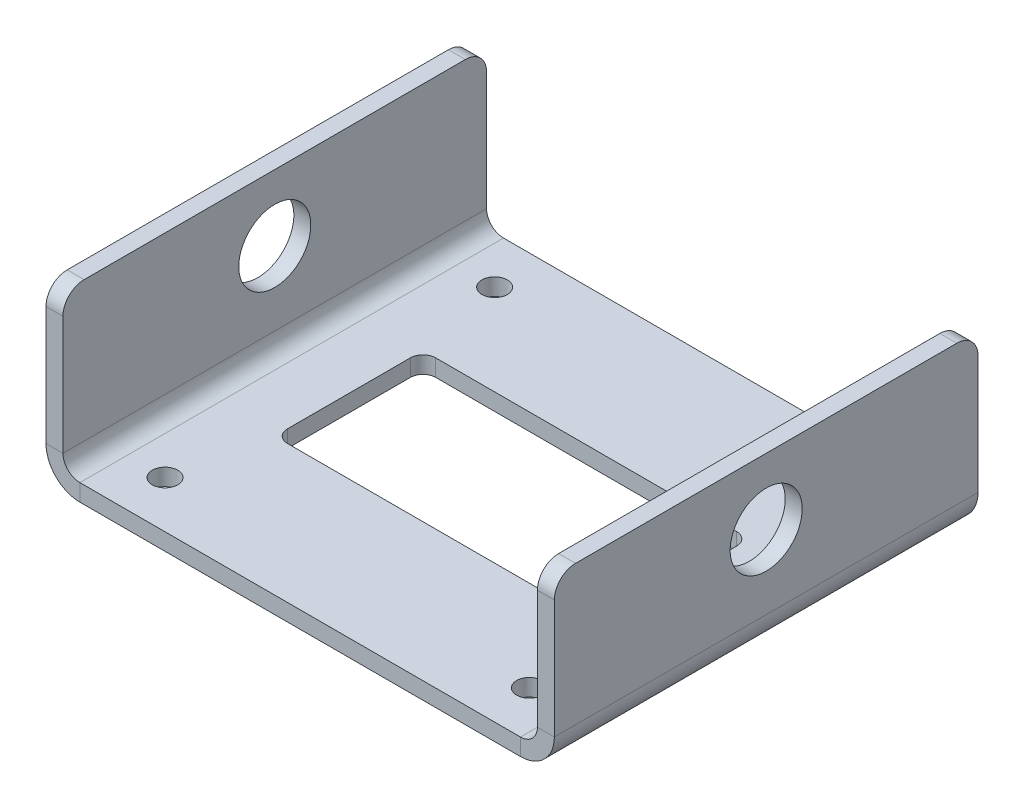
ISO-10303-21;
HEADER;
FILE_DESCRIPTION(('STEP AP214'),'2;1');
FILE_NAME('part.step','',(''),(''),'','','');
FILE_SCHEMA(('AUTOMOTIVE_DESIGN { 1 0 10303 214 1 1 1 1 }'));
ENDSEC;
DATA;
#1=APPLICATION_CONTEXT('core data for automotive mechanical design processes');
#2=APPLICATION_PROTOCOL_DEFINITION('international standard','automotive_design',2000,#1);
#3=PRODUCT_CONTEXT('',#1,'mechanical');
#4=PRODUCT('Part','Part','',(#3));
#5=PRODUCT_RELATED_PRODUCT_CATEGORY('part','',(#4));
#6=PRODUCT_DEFINITION_FORMATION('','',#4);
#7=PRODUCT_DEFINITION_CONTEXT('part definition',#1,'design');
#8=PRODUCT_DEFINITION('design','',#6,#7);
#9=PRODUCT_DEFINITION_SHAPE('','',#8);
#10=(LENGTH_UNIT() NAMED_UNIT(*) SI_UNIT(.MILLI.,.METRE.));
#11=(NAMED_UNIT(*) PLANE_ANGLE_UNIT() SI_UNIT($,.RADIAN.));
#12=(NAMED_UNIT(*) SI_UNIT($,.STERADIAN.) SOLID_ANGLE_UNIT());
#13=UNCERTAINTY_MEASURE_WITH_UNIT(LENGTH_MEASURE(1.E-05),#10,'distance_accuracy_value','');
#14=(GEOMETRIC_REPRESENTATION_CONTEXT(3) GLOBAL_UNCERTAINTY_ASSIGNED_CONTEXT((#13)) GLOBAL_UNIT_ASSIGNED_CONTEXT((#10,
#11,#12)) REPRESENTATION_CONTEXT('',''));
#15=CARTESIAN_POINT('',(0.,0.,0.));
#16=DIRECTION('',(0.,0.,1.));
#17=DIRECTION('',(1.,0.,0.));
#18=AXIS2_PLACEMENT_3D('',#15,#16,#17);
#19=CARTESIAN_POINT('',(52.,0.,100.));
#20=DIRECTION('',(0.,0.,1.));
#21=DIRECTION('',(1.,0.,0.));
#22=AXIS2_PLACEMENT_3D('',#19,#20,#21);
#23=PLANE('',#22);
#24=DIRECTION('',(0.,1.,0.));
#25=VECTOR('',#24,1.);
#26=CARTESIAN_POINT('',(52.,0.,100.));
#27=LINE('',#26,#25);
#28=CARTESIAN_POINT('',(52.,0.,100.));
#29=VERTEX_POINT('',#28);
#30=CARTESIAN_POINT('',(52.,4.,100.));
#31=VERTEX_POINT('',#30);
#32=EDGE_CURVE('E399',#29,#31,#27,.T.);
#33=ORIENTED_EDGE('',*,*,#32,.F.);
#34=CARTESIAN_POINT('',(52.,8.,100.));
#35=DIRECTION('',(0.,0.,1.));
#36=DIRECTION('',(1.,0.,0.));
#37=AXIS2_PLACEMENT_3D('',#34,#35,#36);
#38=CIRCLE('',#37,8.);
#39=CARTESIAN_POINT('',(60.,8.,100.));
#40=VERTEX_POINT('',#39);
#41=EDGE_CURVE('E307',#40,#29,#38,.F.);
#42=ORIENTED_EDGE('',*,*,#41,.F.);
#43=DIRECTION('',(1.,0.,0.));
#44=VECTOR('',#43,1.);
#45=CARTESIAN_POINT('',(56.,8.,100.));
#46=LINE('',#45,#44);
#47=CARTESIAN_POINT('',(56.,8.,100.));
#48=VERTEX_POINT('',#47);
#49=EDGE_CURVE('E396',#48,#40,#46,.T.);
#50=ORIENTED_EDGE('',*,*,#49,.F.);
#51=CARTESIAN_POINT('',(52.,8.,100.));
#52=DIRECTION('',(0.,0.,1.));
#53=DIRECTION('',(1.,0.,0.));
#54=AXIS2_PLACEMENT_3D('',#51,#52,#53);
#55=CIRCLE('',#54,4.);
#56=EDGE_CURVE('E314',#48,#31,#55,.F.);
#57=ORIENTED_EDGE('',*,*,#56,.T.);
#58=EDGE_LOOP('',(#33,#42,#50,#57));
#59=FACE_BOUND('',#58,.T.);
#60=ADVANCED_FACE('F38',(#59),#23,.T.);
#61=CARTESIAN_POINT('',(56.,8.,100.));
#62=DIRECTION('',(0.,0.,1.));
#63=DIRECTION('',(1.,0.,0.));
#64=AXIS2_PLACEMENT_3D('',#61,#62,#63);
#65=PLANE('',#64);
#66=DIRECTION('',(-1.,0.,0.));
#67=VECTOR('',#66,1.);
#68=CARTESIAN_POINT('',(-60.,0.,100.));
#69=LINE('',#68,#67);
#70=CARTESIAN_POINT('',(-52.,0.,100.));
#71=VERTEX_POINT('',#70);
#72=EDGE_CURVE('E304',#29,#71,#69,.T.);
#73=ORIENTED_EDGE('',*,*,#72,.F.);
#74=ORIENTED_EDGE('',*,*,#32,.T.);
#75=DIRECTION('',(1.,0.,0.));
#76=VECTOR('',#75,1.);
#77=CARTESIAN_POINT('',(-60.,4.,100.));
#78=LINE('',#77,#76);
#79=CARTESIAN_POINT('',(-52.,4.,100.));
#80=VERTEX_POINT('',#79);
#81=EDGE_CURVE('E317',#31,#80,#78,.F.);
#82=ORIENTED_EDGE('',*,*,#81,.T.);
#83=DIRECTION('',(0.,-1.,0.));
#84=VECTOR('',#83,1.);
#85=CARTESIAN_POINT('',(-52.,4.,100.));
#86=LINE('',#85,#84);
#87=EDGE_CURVE('E387',#80,#71,#86,.T.);
#88=ORIENTED_EDGE('',*,*,#87,.T.);
#89=EDGE_LOOP('',(#73,#74,#82,#88));
#90=FACE_BOUND('',#89,.T.);
#91=ADVANCED_FACE('F467',(#90),#65,.T.);
#92=CARTESIAN_POINT('',(60.,8.,0.));
#93=DIRECTION('',(0.,0.,-1.));
#94=DIRECTION('',(-1.,0.,0.));
#95=AXIS2_PLACEMENT_3D('',#92,#93,#94);
#96=PLANE('',#95);
#97=DIRECTION('',(-1.,0.,0.));
#98=VECTOR('',#97,1.);
#99=CARTESIAN_POINT('',(60.,8.,0.));
#100=LINE('',#99,#98);
#101=CARTESIAN_POINT('',(60.,8.,0.));
#102=VERTEX_POINT('',#101);
#103=CARTESIAN_POINT('',(56.,8.,0.));
#104=VERTEX_POINT('',#103);
#105=EDGE_CURVE('E393',#102,#104,#100,.T.);
#106=ORIENTED_EDGE('',*,*,#105,.F.);
#107=CARTESIAN_POINT('',(52.,8.,0.));
#108=DIRECTION('',(0.,0.,1.));
#109=DIRECTION('',(1.,0.,0.));
#110=AXIS2_PLACEMENT_3D('',#107,#108,#109);
#111=CIRCLE('',#110,8.);
#112=CARTESIAN_POINT('',(52.,0.,0.));
#113=VERTEX_POINT('',#112);
#114=EDGE_CURVE('E335',#102,#113,#111,.F.);
#115=ORIENTED_EDGE('',*,*,#114,.T.);
#116=DIRECTION('',(0.,-1.,0.));
#117=VECTOR('',#116,1.);
#118=CARTESIAN_POINT('',(52.,4.,0.));
#119=LINE('',#118,#117);
#120=CARTESIAN_POINT('',(52.,4.,0.));
#121=VERTEX_POINT('',#120);
#122=EDGE_CURVE('E391',#121,#113,#119,.T.);
#123=ORIENTED_EDGE('',*,*,#122,.F.);
#124=CARTESIAN_POINT('',(52.,8.,0.));
#125=DIRECTION('',(0.,0.,1.));
#126=DIRECTION('',(1.,0.,0.));
#127=AXIS2_PLACEMENT_3D('',#124,#125,#126);
#128=CIRCLE('',#127,4.);
#129=EDGE_CURVE('E342',#104,#121,#128,.F.);
#130=ORIENTED_EDGE('',*,*,#129,.F.);
#131=EDGE_LOOP('',(#106,#115,#123,#130));
#132=FACE_BOUND('',#131,.T.);
#133=ADVANCED_FACE('F527',(#132),#96,.T.);
#134=CARTESIAN_POINT('',(52.,4.,0.));
#135=DIRECTION('',(0.,0.,-1.));
#136=DIRECTION('',(-1.,0.,0.));
#137=AXIS2_PLACEMENT_3D('',#134,#135,#136);
#138=PLANE('',#137);
#139=DIRECTION('',(0.,1.,0.));
#140=VECTOR('',#139,1.);
#141=CARTESIAN_POINT('',(56.,0.,0.));
#142=LINE('',#141,#140);
#143=CARTESIAN_POINT('',(56.,36.,0.));
#144=VERTEX_POINT('',#143);
#145=EDGE_CURVE('E340',#144,#104,#142,.F.);
#146=ORIENTED_EDGE('',*,*,#145,.F.);
#147=DIRECTION('',(1.,0.,0.));
#148=VECTOR('',#147,1.);
#149=CARTESIAN_POINT('',(52.,36.,0.));
#150=LINE('',#149,#148);
#151=CARTESIAN_POINT('',(60.,36.,0.));
#152=VERTEX_POINT('',#151);
#153=EDGE_CURVE('E421',#144,#152,#150,.T.);
#154=ORIENTED_EDGE('',*,*,#153,.T.);
#155=DIRECTION('',(0.,-1.,0.));
#156=VECTOR('',#155,1.);
#157=CARTESIAN_POINT('',(60.,0.,0.));
#158=LINE('',#157,#156);
#159=EDGE_CURVE('E338',#152,#102,#158,.T.);
#160=ORIENTED_EDGE('',*,*,#159,.T.);
#161=ORIENTED_EDGE('',*,*,#105,.T.);
#162=EDGE_LOOP('',(#146,#154,#160,#161));
#163=FACE_BOUND('',#162,.T.);
#164=ADVANCED_FACE('F441',(#163),#138,.T.);
#165=CARTESIAN_POINT('',(-60.,8.,100.));
#166=DIRECTION('',(0.,0.,1.));
#167=DIRECTION('',(1.,0.,0.));
#168=AXIS2_PLACEMENT_3D('',#165,#166,#167);
#169=PLANE('',#168);
#170=DIRECTION('',(1.,0.,0.));
#171=VECTOR('',#170,1.);
#172=CARTESIAN_POINT('',(-60.,8.,100.));
#173=LINE('',#172,#171);
#174=CARTESIAN_POINT('',(-60.,8.,100.));
#175=VERTEX_POINT('',#174);
#176=CARTESIAN_POINT('',(-56.,8.,100.));
#177=VERTEX_POINT('',#176);
#178=EDGE_CURVE('E389',#175,#177,#173,.T.);
#179=ORIENTED_EDGE('',*,*,#178,.F.);
#180=CARTESIAN_POINT('',(-52.,8.,100.));
#181=DIRECTION('',(0.,0.,1.));
#182=DIRECTION('',(1.,0.,0.));
#183=AXIS2_PLACEMENT_3D('',#180,#181,#182);
#184=CIRCLE('',#183,8.);
#185=EDGE_CURVE('E301',#71,#175,#184,.F.);
#186=ORIENTED_EDGE('',*,*,#185,.F.);
#187=ORIENTED_EDGE('',*,*,#87,.F.);
#188=CARTESIAN_POINT('',(-52.,8.,100.));
#189=DIRECTION('',(0.,0.,1.));
#190=DIRECTION('',(1.,0.,0.));
#191=AXIS2_PLACEMENT_3D('',#188,#189,#190);
#192=CIRCLE('',#191,4.);
#193=EDGE_CURVE('E320',#80,#177,#192,.F.);
#194=ORIENTED_EDGE('',*,*,#193,.T.);
#195=EDGE_LOOP('',(#179,#186,#187,#194));
#196=FACE_BOUND('',#195,.T.);
#197=ADVANCED_FACE('F476',(#196),#169,.T.);
#198=CARTESIAN_POINT('',(-52.,4.,100.));
#199=DIRECTION('',(0.,0.,1.));
#200=DIRECTION('',(1.,0.,0.));
#201=AXIS2_PLACEMENT_3D('',#198,#199,#200);
#202=PLANE('',#201);
#203=DIRECTION('',(0.,1.,0.));
#204=VECTOR('',#203,1.);
#205=CARTESIAN_POINT('',(-56.,0.,100.));
#206=LINE('',#205,#204);
#207=CARTESIAN_POINT('',(-56.,36.,100.));
#208=VERTEX_POINT('',#207);
#209=EDGE_CURVE('E294',#177,#208,#206,.T.);
#210=ORIENTED_EDGE('',*,*,#209,.T.);
#211=DIRECTION('',(1.,0.,0.));
#212=VECTOR('',#211,1.);
#213=CARTESIAN_POINT('',(-52.,36.,100.));
#214=LINE('',#213,#212);
#215=CARTESIAN_POINT('',(-60.,36.,100.));
#216=VERTEX_POINT('',#215);
#217=EDGE_CURVE('E412',#208,#216,#214,.F.);
#218=ORIENTED_EDGE('',*,*,#217,.T.);
#219=DIRECTION('',(0.,1.,0.));
#220=VECTOR('',#219,1.);
#221=CARTESIAN_POINT('',(-60.,0.,100.));
#222=LINE('',#221,#220);
#223=EDGE_CURVE('E297',#175,#216,#222,.T.);
#224=ORIENTED_EDGE('',*,*,#223,.F.);
#225=ORIENTED_EDGE('',*,*,#178,.T.);
#226=EDGE_LOOP('',(#210,#218,#224,#225));
#227=FACE_BOUND('',#226,.T.);
#228=ADVANCED_FACE('F486',(#227),#202,.T.);
#229=CARTESIAN_POINT('',(-52.,0.,0.));
#230=DIRECTION('',(0.,0.,-1.));
#231=DIRECTION('',(-1.,0.,0.));
#232=AXIS2_PLACEMENT_3D('',#229,#230,#231);
#233=PLANE('',#232);
#234=DIRECTION('',(0.,1.,0.));
#235=VECTOR('',#234,1.);
#236=CARTESIAN_POINT('',(-52.,0.,0.));
#237=LINE('',#236,#235);
#238=CARTESIAN_POINT('',(-52.,0.,0.));
#239=VERTEX_POINT('',#238);
#240=CARTESIAN_POINT('',(-52.,4.,0.));
#241=VERTEX_POINT('',#240);
#242=EDGE_CURVE('E385',#239,#241,#237,.T.);
#243=ORIENTED_EDGE('',*,*,#242,.F.);
#244=CARTESIAN_POINT('',(-52.,8.,0.));
#245=DIRECTION('',(0.,0.,1.));
#246=DIRECTION('',(1.,0.,0.));
#247=AXIS2_PLACEMENT_3D('',#244,#245,#246);
#248=CIRCLE('',#247,8.);
#249=CARTESIAN_POINT('',(-60.,8.,0.));
#250=VERTEX_POINT('',#249);
#251=EDGE_CURVE('E329',#239,#250,#248,.F.);
#252=ORIENTED_EDGE('',*,*,#251,.T.);
#253=DIRECTION('',(-1.,0.,0.));
#254=VECTOR('',#253,1.);
#255=CARTESIAN_POINT('',(-56.,8.,0.));
#256=LINE('',#255,#254);
#257=CARTESIAN_POINT('',(-56.,8.,0.));
#258=VERTEX_POINT('',#257);
#259=EDGE_CURVE('E383',#258,#250,#256,.T.);
#260=ORIENTED_EDGE('',*,*,#259,.F.);
#261=CARTESIAN_POINT('',(-52.,8.,0.));
#262=DIRECTION('',(0.,0.,1.));
#263=DIRECTION('',(1.,0.,0.));
#264=AXIS2_PLACEMENT_3D('',#261,#262,#263);
#265=CIRCLE('',#264,4.);
#266=EDGE_CURVE('E298',#241,#258,#265,.F.);
#267=ORIENTED_EDGE('',*,*,#266,.F.);
#268=EDGE_LOOP('',(#243,#252,#260,#267));
#269=FACE_BOUND('',#268,.T.);
#270=ADVANCED_FACE('F506',(#269),#233,.T.);
#271=CARTESIAN_POINT('',(-56.,8.,0.));
#272=DIRECTION('',(0.,0.,-1.));
#273=DIRECTION('',(-1.,0.,0.));
#274=AXIS2_PLACEMENT_3D('',#271,#272,#273);
#275=PLANE('',#274);
#276=DIRECTION('',(-1.,0.,0.));
#277=VECTOR('',#276,1.);
#278=CARTESIAN_POINT('',(-60.,0.,0.));
#279=LINE('',#278,#277);
#280=EDGE_CURVE('E332',#113,#239,#279,.T.);
#281=ORIENTED_EDGE('',*,*,#280,.T.);
#282=ORIENTED_EDGE('',*,*,#242,.T.);
#283=DIRECTION('',(1.,0.,0.));
#284=VECTOR('',#283,1.);
#285=CARTESIAN_POINT('',(-60.,4.,0.));
#286=LINE('',#285,#284);
#287=EDGE_CURVE('E345',#121,#241,#286,.F.);
#288=ORIENTED_EDGE('',*,*,#287,.F.);
#289=ORIENTED_EDGE('',*,*,#122,.T.);
#290=EDGE_LOOP('',(#281,#282,#288,#289));
#291=FACE_BOUND('',#290,.T.);
#292=ADVANCED_FACE('F512',(#291),#275,.T.);
#293=CARTESIAN_POINT('',(-56.,0.,100.));
#294=DIRECTION('',(-1.,0.,0.));
#295=DIRECTION('',(0.,0.,1.));
#296=AXIS2_PLACEMENT_3D('',#293,#294,#295);
#297=PLANE('',#296);
#298=CARTESIAN_POINT('',(-56.,25.4,50.));
#299=DIRECTION('',(-1.,0.,0.));
#300=DIRECTION('',(0.,0.,1.));
#301=AXIS2_PLACEMENT_3D('',#298,#299,#300);
#302=CIRCLE('',#301,8.5);
#303=CARTESIAN_POINT('',(-56.,25.4,58.5));
#304=VERTEX_POINT('',#303);
#305=EDGE_CURVE('E290',#304,#304,#302,.T.);
#306=ORIENTED_EDGE('',*,*,#305,.T.);
#307=EDGE_LOOP('',(#306));
#308=FACE_BOUND('',#307,.T.);
#309=DIRECTION('',(0.,0.,-1.));
#310=VECTOR('',#309,1.);
#311=CARTESIAN_POINT('',(-56.,41.,100.));
#312=LINE('',#311,#310);
#313=CARTESIAN_POINT('',(-56.,41.,95.));
#314=VERTEX_POINT('',#313);
#315=CARTESIAN_POINT('',(-56.,41.,5.));
#316=VERTEX_POINT('',#315);
#317=EDGE_CURVE('E380',#314,#316,#312,.T.);
#318=ORIENTED_EDGE('',*,*,#317,.F.);
#319=CARTESIAN_POINT('',(-56.,36.,95.));
#320=DIRECTION('',(-1.,0.,0.));
#321=DIRECTION('',(0.,0.,1.));
#322=AXIS2_PLACEMENT_3D('',#319,#320,#321);
#323=CIRCLE('',#322,5.);
#324=EDGE_CURVE('E410',#314,#208,#323,.F.);
#325=ORIENTED_EDGE('',*,*,#324,.T.);
#326=ORIENTED_EDGE('',*,*,#209,.F.);
#327=DIRECTION('',(0.,0.,-1.));
#328=VECTOR('',#327,1.);
#329=CARTESIAN_POINT('',(-56.,8.,100.));
#330=LINE('',#329,#328);
#331=EDGE_CURVE('E323',#177,#258,#330,.T.);
#332=ORIENTED_EDGE('',*,*,#331,.T.);
#333=DIRECTION('',(0.,1.,0.));
#334=VECTOR('',#333,1.);
#335=CARTESIAN_POINT('',(-56.,0.,0.));
#336=LINE('',#335,#334);
#337=CARTESIAN_POINT('',(-56.,36.,0.));
#338=VERTEX_POINT('',#337);
#339=EDGE_CURVE('E293',#258,#338,#336,.T.);
#340=ORIENTED_EDGE('',*,*,#339,.T.);
#341=CARTESIAN_POINT('',(-56.,36.,5.));
#342=DIRECTION('',(-1.,0.,0.));
#343=DIRECTION('',(0.,0.,1.));
#344=AXIS2_PLACEMENT_3D('',#341,#342,#343);
#345=CIRCLE('',#344,5.);
#346=EDGE_CURVE('E408',#338,#316,#345,.F.);
#347=ORIENTED_EDGE('',*,*,#346,.T.);
#348=EDGE_LOOP('',(#318,#325,#326,#332,#340,#347));
#349=FACE_BOUND('',#348,.T.);
#350=ADVANCED_FACE('F510',(#308,#349),#297,.F.);
#351=CARTESIAN_POINT('',(-60.,41.,100.));
#352=DIRECTION('',(0.,1.,0.));
#353=DIRECTION('',(0.,0.,1.));
#354=AXIS2_PLACEMENT_3D('',#351,#352,#353);
#355=PLANE('',#354);
#356=DIRECTION('',(0.,0.,-1.));
#357=VECTOR('',#356,1.);
#358=CARTESIAN_POINT('',(-60.,41.,100.));
#359=LINE('',#358,#357);
#360=CARTESIAN_POINT('',(-60.,41.,95.));
#361=VERTEX_POINT('',#360);
#362=CARTESIAN_POINT('',(-60.,41.,5.));
#363=VERTEX_POINT('',#362);
#364=EDGE_CURVE('E377',#361,#363,#359,.T.);
#365=ORIENTED_EDGE('',*,*,#364,.F.);
#366=DIRECTION('',(1.,0.,0.));
#367=VECTOR('',#366,1.);
#368=CARTESIAN_POINT('',(-60.,41.,95.));
#369=LINE('',#368,#367);
#370=EDGE_CURVE('E405',#361,#314,#369,.T.);
#371=ORIENTED_EDGE('',*,*,#370,.T.);
#372=ORIENTED_EDGE('',*,*,#317,.T.);
#373=DIRECTION('',(1.,0.,0.));
#374=VECTOR('',#373,1.);
#375=CARTESIAN_POINT('',(-60.,41.,5.));
#376=LINE('',#375,#374);
#377=EDGE_CURVE('E401',#316,#363,#376,.F.);
#378=ORIENTED_EDGE('',*,*,#377,.T.);
#379=EDGE_LOOP('',(#365,#371,#372,#378));
#380=FACE_BOUND('',#379,.T.);
#381=ADVANCED_FACE('F495',(#380),#355,.T.);
#382=CARTESIAN_POINT('',(-60.,0.,100.));
#383=DIRECTION('',(-1.,0.,0.));
#384=DIRECTION('',(0.,0.,1.));
#385=AXIS2_PLACEMENT_3D('',#382,#383,#384);
#386=PLANE('',#385);
#387=CARTESIAN_POINT('',(-60.,25.4,50.));
#388=DIRECTION('',(-1.,0.,0.));
#389=DIRECTION('',(0.,0.,1.));
#390=AXIS2_PLACEMENT_3D('',#387,#388,#389);
#391=CIRCLE('',#390,8.5);
#392=CARTESIAN_POINT('',(-60.,25.4,58.5));
#393=VERTEX_POINT('',#392);
#394=EDGE_CURVE('E286',#393,#393,#391,.F.);
#395=ORIENTED_EDGE('',*,*,#394,.T.);
#396=EDGE_LOOP('',(#395));
#397=FACE_BOUND('',#396,.T.);
#398=ORIENTED_EDGE('',*,*,#223,.T.);
#399=CARTESIAN_POINT('',(-60.,36.,95.));
#400=DIRECTION('',(-1.,0.,0.));
#401=DIRECTION('',(0.,0.,1.));
#402=AXIS2_PLACEMENT_3D('',#399,#400,#401);
#403=CIRCLE('',#402,5.);
#404=EDGE_CURVE('E416',#216,#361,#403,.T.);
#405=ORIENTED_EDGE('',*,*,#404,.T.);
#406=ORIENTED_EDGE('',*,*,#364,.T.);
#407=CARTESIAN_POINT('',(-60.,36.,5.));
#408=DIRECTION('',(-1.,0.,0.));
#409=DIRECTION('',(0.,0.,1.));
#410=AXIS2_PLACEMENT_3D('',#407,#408,#409);
#411=CIRCLE('',#410,5.);
#412=CARTESIAN_POINT('',(-60.,36.,0.));
#413=VERTEX_POINT('',#412);
#414=EDGE_CURVE('E414',#363,#413,#411,.T.);
#415=ORIENTED_EDGE('',*,*,#414,.T.);
#416=DIRECTION('',(0.,1.,0.));
#417=VECTOR('',#416,1.);
#418=CARTESIAN_POINT('',(-60.,0.,0.));
#419=LINE('',#418,#417);
#420=EDGE_CURVE('E326',#250,#413,#419,.T.);
#421=ORIENTED_EDGE('',*,*,#420,.F.);
#422=DIRECTION('',(0.,0.,-1.));
#423=VECTOR('',#422,1.);
#424=CARTESIAN_POINT('',(-60.,8.,100.));
#425=LINE('',#424,#423);
#426=EDGE_CURVE('E374',#175,#250,#425,.T.);
#427=ORIENTED_EDGE('',*,*,#426,.F.);
#428=EDGE_LOOP('',(#398,#405,#406,#415,#421,#427));
#429=FACE_BOUND('',#428,.T.);
#430=ADVANCED_FACE('F484',(#397,#429),#386,.T.);
#431=CARTESIAN_POINT('',(-52.,8.,100.));
#432=DIRECTION('',(0.,0.,-1.));
#433=DIRECTION('',(-1.,0.,0.));
#434=AXIS2_PLACEMENT_3D('',#431,#432,#433);
#435=CYLINDRICAL_SURFACE('',#434,8.);
#436=ORIENTED_EDGE('',*,*,#251,.F.);
#437=DIRECTION('',(0.,0.,-1.));
#438=VECTOR('',#437,1.);
#439=CARTESIAN_POINT('',(-52.,0.,100.));
#440=LINE('',#439,#438);
#441=EDGE_CURVE('E371',#71,#239,#440,.T.);
#442=ORIENTED_EDGE('',*,*,#441,.F.);
#443=ORIENTED_EDGE('',*,*,#185,.T.);
#444=ORIENTED_EDGE('',*,*,#426,.T.);
#445=EDGE_LOOP('',(#436,#442,#443,#444));
#446=FACE_BOUND('',#445,.T.);
#447=ADVANCED_FACE('F475',(#446),#435,.T.);
#448=CARTESIAN_POINT('',(-60.,0.,100.));
#449=DIRECTION('',(0.,-1.,0.));
#450=DIRECTION('',(0.,0.,-1.));
#451=AXIS2_PLACEMENT_3D('',#448,#449,#450);
#452=PLANE('',#451);
#453=CARTESIAN_POINT('',(43.,0.,11.1));
#454=DIRECTION('',(0.,-1.,0.));
#455=DIRECTION('',(0.,0.,-1.));
#456=AXIS2_PLACEMENT_3D('',#453,#454,#455);
#457=CIRCLE('',#456,3.);
#458=CARTESIAN_POINT('',(43.,0.,8.09999999999999));
#459=VERTEX_POINT('',#458);
#460=EDGE_CURVE('E268',#459,#459,#457,.F.);
#461=ORIENTED_EDGE('',*,*,#460,.T.);
#462=EDGE_LOOP('',(#461));
#463=FACE_BOUND('',#462,.T.);
#464=CARTESIAN_POINT('',(-43.,0.,88.9));
#465=DIRECTION('',(0.,-1.,0.));
#466=DIRECTION('',(0.,0.,-1.));
#467=AXIS2_PLACEMENT_3D('',#464,#465,#466);
#468=CIRCLE('',#467,2.99999999999999);
#469=CARTESIAN_POINT('',(-43.,0.,85.9));
#470=VERTEX_POINT('',#469);
#471=EDGE_CURVE('E274',#470,#470,#468,.F.);
#472=ORIENTED_EDGE('',*,*,#471,.T.);
#473=EDGE_LOOP('',(#472));
#474=FACE_BOUND('',#473,.T.);
#475=CARTESIAN_POINT('',(43.,0.,88.9));
#476=DIRECTION('',(0.,-1.,0.));
#477=DIRECTION('',(0.,0.,-1.));
#478=AXIS2_PLACEMENT_3D('',#475,#476,#477);
#479=CIRCLE('',#478,2.99999999999999);
#480=CARTESIAN_POINT('',(43.,0.,85.9));
#481=VERTEX_POINT('',#480);
#482=EDGE_CURVE('E211',#481,#481,#479,.F.);
#483=ORIENTED_EDGE('',*,*,#482,.T.);
#484=EDGE_LOOP('',(#483));
#485=FACE_BOUND('',#484,.T.);
#486=CARTESIAN_POINT('',(-35.5,0.,35.5));
#487=DIRECTION('',(0.,-1.,0.));
#488=DIRECTION('',(0.,0.,-1.));
#489=AXIS2_PLACEMENT_3D('',#486,#487,#488);
#490=CIRCLE('',#489,3.);
#491=CARTESIAN_POINT('',(-35.5,0.,32.5));
#492=VERTEX_POINT('',#491);
#493=CARTESIAN_POINT('',(-38.5,0.,35.5));
#494=VERTEX_POINT('',#493);
#495=EDGE_CURVE('E216',#492,#494,#490,.F.);
#496=ORIENTED_EDGE('',*,*,#495,.T.);
#497=DIRECTION('',(0.,0.,1.));
#498=VECTOR('',#497,1.);
#499=CARTESIAN_POINT('',(-38.5,0.,64.5));
#500=LINE('',#499,#498);
#501=CARTESIAN_POINT('',(-38.5,0.,64.5));
#502=VERTEX_POINT('',#501);
#503=EDGE_CURVE('E200',#494,#502,#500,.T.);
#504=ORIENTED_EDGE('',*,*,#503,.T.);
#505=CARTESIAN_POINT('',(-35.5,0.,64.5));
#506=DIRECTION('',(0.,-1.,0.));
#507=DIRECTION('',(0.,0.,-1.));
#508=AXIS2_PLACEMENT_3D('',#505,#506,#507);
#509=CIRCLE('',#508,3.);
#510=CARTESIAN_POINT('',(-35.5,0.,67.5));
#511=VERTEX_POINT('',#510);
#512=EDGE_CURVE('E956',#502,#511,#509,.F.);
#513=ORIENTED_EDGE('',*,*,#512,.T.);
#514=DIRECTION('',(1.,0.,0.));
#515=VECTOR('',#514,1.);
#516=CARTESIAN_POINT('',(-35.5,0.,67.5));
#517=LINE('',#516,#515);
#518=CARTESIAN_POINT('',(35.5,0.,67.5));
#519=VERTEX_POINT('',#518);
#520=EDGE_CURVE('E958',#511,#519,#517,.T.);
#521=ORIENTED_EDGE('',*,*,#520,.T.);
#522=CARTESIAN_POINT('',(35.5,0.,64.5));
#523=DIRECTION('',(0.,-1.,0.));
#524=DIRECTION('',(0.,0.,-1.));
#525=AXIS2_PLACEMENT_3D('',#522,#523,#524);
#526=CIRCLE('',#525,3.);
#527=CARTESIAN_POINT('',(38.5,0.,64.5));
#528=VERTEX_POINT('',#527);
#529=EDGE_CURVE('E961',#519,#528,#526,.F.);
#530=ORIENTED_EDGE('',*,*,#529,.T.);
#531=DIRECTION('',(0.,0.,-1.));
#532=VECTOR('',#531,1.);
#533=CARTESIAN_POINT('',(38.5,0.,64.5));
#534=LINE('',#533,#532);
#535=CARTESIAN_POINT('',(38.5,0.,35.5));
#536=VERTEX_POINT('',#535);
#537=EDGE_CURVE('E964',#528,#536,#534,.T.);
#538=ORIENTED_EDGE('',*,*,#537,.T.);
#539=CARTESIAN_POINT('',(35.5,0.,35.5));
#540=DIRECTION('',(0.,-1.,0.));
#541=DIRECTION('',(0.,0.,-1.));
#542=AXIS2_PLACEMENT_3D('',#539,#540,#541);
#543=CIRCLE('',#542,3.);
#544=CARTESIAN_POINT('',(35.5,0.,32.5));
#545=VERTEX_POINT('',#544);
#546=EDGE_CURVE('E230',#536,#545,#543,.F.);
#547=ORIENTED_EDGE('',*,*,#546,.T.);
#548=DIRECTION('',(-1.,0.,0.));
#549=VECTOR('',#548,1.);
#550=CARTESIAN_POINT('',(-35.5,0.,32.5));
#551=LINE('',#550,#549);
#552=EDGE_CURVE('E226',#545,#492,#551,.T.);
#553=ORIENTED_EDGE('',*,*,#552,.T.);
#554=EDGE_LOOP('',(#496,#504,#513,#521,#530,#538,#547,#553));
#555=FACE_BOUND('',#554,.T.);
#556=CARTESIAN_POINT('',(-43.,0.,11.1));
#557=DIRECTION('',(0.,-1.,0.));
#558=DIRECTION('',(0.,0.,-1.));
#559=AXIS2_PLACEMENT_3D('',#556,#557,#558);
#560=CIRCLE('',#559,3.);
#561=CARTESIAN_POINT('',(-43.,0.,8.1));
#562=VERTEX_POINT('',#561);
#563=EDGE_CURVE('E267',#562,#562,#560,.F.);
#564=ORIENTED_EDGE('',*,*,#563,.T.);
#565=EDGE_LOOP('',(#564));
#566=FACE_BOUND('',#565,.T.);
#567=ORIENTED_EDGE('',*,*,#280,.F.);
#568=DIRECTION('',(0.,0.,-1.));
#569=VECTOR('',#568,1.);
#570=CARTESIAN_POINT('',(52.,0.,100.));
#571=LINE('',#570,#569);
#572=EDGE_CURVE('E368',#29,#113,#571,.T.);
#573=ORIENTED_EDGE('',*,*,#572,.F.);
#574=ORIENTED_EDGE('',*,*,#72,.T.);
#575=ORIENTED_EDGE('',*,*,#441,.T.);
#576=EDGE_LOOP('',(#567,#573,#574,#575));
#577=FACE_BOUND('',#576,.T.);
#578=ADVANCED_FACE('F223',(#463,#474,#485,#555,#566,#577),#452,.T.);
#579=CARTESIAN_POINT('',(52.,8.,100.));
#580=DIRECTION('',(0.,0.,-1.));
#581=DIRECTION('',(-1.,0.,0.));
#582=AXIS2_PLACEMENT_3D('',#579,#580,#581);
#583=CYLINDRICAL_SURFACE('',#582,8.);
#584=ORIENTED_EDGE('',*,*,#114,.F.);
#585=DIRECTION('',(0.,0.,-1.));
#586=VECTOR('',#585,1.);
#587=CARTESIAN_POINT('',(60.,8.,100.));
#588=LINE('',#587,#586);
#589=EDGE_CURVE('E365',#40,#102,#588,.T.);
#590=ORIENTED_EDGE('',*,*,#589,.F.);
#591=ORIENTED_EDGE('',*,*,#41,.T.);
#592=ORIENTED_EDGE('',*,*,#572,.T.);
#593=EDGE_LOOP('',(#584,#590,#591,#592));
#594=FACE_BOUND('',#593,.T.);
#595=ADVANCED_FACE('F459',(#594),#583,.T.);
#596=CARTESIAN_POINT('',(60.,0.,100.));
#597=DIRECTION('',(1.,0.,0.));
#598=DIRECTION('',(0.,0.,-1.));
#599=AXIS2_PLACEMENT_3D('',#596,#597,#598);
#600=PLANE('',#599);
#601=CARTESIAN_POINT('',(60.,25.4,50.));
#602=DIRECTION('',(1.,0.,0.));
#603=DIRECTION('',(0.,0.,-1.));
#604=AXIS2_PLACEMENT_3D('',#601,#602,#603);
#605=CIRCLE('',#604,8.5);
#606=CARTESIAN_POINT('',(60.,25.4,41.5));
#607=VERTEX_POINT('',#606);
#608=EDGE_CURVE('E281',#607,#607,#605,.T.);
#609=ORIENTED_EDGE('',*,*,#608,.F.);
#610=EDGE_LOOP('',(#609));
#611=FACE_BOUND('',#610,.T.);
#612=ORIENTED_EDGE('',*,*,#159,.F.);
#613=CARTESIAN_POINT('',(60.,36.,5.));
#614=DIRECTION('',(1.,0.,0.));
#615=DIRECTION('',(0.,0.,-1.));
#616=AXIS2_PLACEMENT_3D('',#613,#614,#615);
#617=CIRCLE('',#616,5.);
#618=CARTESIAN_POINT('',(60.,41.,5.));
#619=VERTEX_POINT('',#618);
#620=EDGE_CURVE('E426',#152,#619,#617,.T.);
#621=ORIENTED_EDGE('',*,*,#620,.T.);
#622=DIRECTION('',(0.,0.,-1.));
#623=VECTOR('',#622,1.);
#624=CARTESIAN_POINT('',(60.,41.,100.));
#625=LINE('',#624,#623);
#626=CARTESIAN_POINT('',(60.,41.,95.));
#627=VERTEX_POINT('',#626);
#628=EDGE_CURVE('E363',#627,#619,#625,.T.);
#629=ORIENTED_EDGE('',*,*,#628,.F.);
#630=CARTESIAN_POINT('',(60.,36.,95.));
#631=DIRECTION('',(1.,0.,0.));
#632=DIRECTION('',(0.,0.,-1.));
#633=AXIS2_PLACEMENT_3D('',#630,#631,#632);
#634=CIRCLE('',#633,5.);
#635=CARTESIAN_POINT('',(60.,36.,100.));
#636=VERTEX_POINT('',#635);
#637=EDGE_CURVE('E424',#627,#636,#634,.T.);
#638=ORIENTED_EDGE('',*,*,#637,.T.);
#639=DIRECTION('',(0.,-1.,0.));
#640=VECTOR('',#639,1.);
#641=CARTESIAN_POINT('',(60.,0.,100.));
#642=LINE('',#641,#640);
#643=EDGE_CURVE('E310',#636,#40,#642,.T.);
#644=ORIENTED_EDGE('',*,*,#643,.T.);
#645=ORIENTED_EDGE('',*,*,#589,.T.);
#646=EDGE_LOOP('',(#612,#621,#629,#638,#644,#645));
#647=FACE_BOUND('',#646,.T.);
#648=ADVANCED_FACE('F447',(#611,#647),#600,.T.);
#649=CARTESIAN_POINT('',(56.,41.,100.));
#650=DIRECTION('',(0.,1.,0.));
#651=DIRECTION('',(0.,0.,1.));
#652=AXIS2_PLACEMENT_3D('',#649,#650,#651);
#653=PLANE('',#652);
#654=ORIENTED_EDGE('',*,*,#628,.T.);
#655=DIRECTION('',(1.,0.,0.));
#656=VECTOR('',#655,1.);
#657=CARTESIAN_POINT('',(56.,41.,5.));
#658=LINE('',#657,#656);
#659=CARTESIAN_POINT('',(56.,41.,5.));
#660=VERTEX_POINT('',#659);
#661=EDGE_CURVE('E59',#619,#660,#658,.F.);
#662=ORIENTED_EDGE('',*,*,#661,.T.);
#663=DIRECTION('',(0.,0.,-1.));
#664=VECTOR('',#663,1.);
#665=CARTESIAN_POINT('',(56.,41.,100.));
#666=LINE('',#665,#664);
#667=CARTESIAN_POINT('',(56.,41.,95.));
#668=VERTEX_POINT('',#667);
#669=EDGE_CURVE('E361',#668,#660,#666,.T.);
#670=ORIENTED_EDGE('',*,*,#669,.F.);
#671=DIRECTION('',(1.,0.,0.));
#672=VECTOR('',#671,1.);
#673=CARTESIAN_POINT('',(56.,41.,95.));
#674=LINE('',#673,#672);
#675=EDGE_CURVE('E428',#668,#627,#674,.T.);
#676=ORIENTED_EDGE('',*,*,#675,.T.);
#677=EDGE_LOOP('',(#654,#662,#670,#676));
#678=FACE_BOUND('',#677,.T.);
#679=ADVANCED_FACE('F448',(#678),#653,.T.);
#680=CARTESIAN_POINT('',(56.,0.,100.));
#681=DIRECTION('',(1.,0.,0.));
#682=DIRECTION('',(0.,0.,-1.));
#683=AXIS2_PLACEMENT_3D('',#680,#681,#682);
#684=PLANE('',#683);
#685=CARTESIAN_POINT('',(56.,25.4,50.));
#686=DIRECTION('',(1.,0.,0.));
#687=DIRECTION('',(0.,0.,-1.));
#688=AXIS2_PLACEMENT_3D('',#685,#686,#687);
#689=CIRCLE('',#688,8.5);
#690=CARTESIAN_POINT('',(56.,25.4,41.5));
#691=VERTEX_POINT('',#690);
#692=EDGE_CURVE('E289',#691,#691,#689,.T.);
#693=ORIENTED_EDGE('',*,*,#692,.T.);
#694=EDGE_LOOP('',(#693));
#695=FACE_BOUND('',#694,.T.);
#696=ORIENTED_EDGE('',*,*,#669,.T.);
#697=CARTESIAN_POINT('',(56.,36.,5.));
#698=DIRECTION('',(1.,0.,0.));
#699=DIRECTION('',(0.,0.,-1.));
#700=AXIS2_PLACEMENT_3D('',#697,#698,#699);
#701=CIRCLE('',#700,5.);
#702=EDGE_CURVE('E46',#660,#144,#701,.F.);
#703=ORIENTED_EDGE('',*,*,#702,.T.);
#704=ORIENTED_EDGE('',*,*,#145,.T.);
#705=DIRECTION('',(0.,0.,-1.));
#706=VECTOR('',#705,1.);
#707=CARTESIAN_POINT('',(56.,8.,100.));
#708=LINE('',#707,#706);
#709=EDGE_CURVE('E358',#48,#104,#708,.T.);
#710=ORIENTED_EDGE('',*,*,#709,.F.);
#711=DIRECTION('',(0.,1.,0.));
#712=VECTOR('',#711,1.);
#713=CARTESIAN_POINT('',(56.,0.,100.));
#714=LINE('',#713,#712);
#715=CARTESIAN_POINT('',(56.,36.,100.));
#716=VERTEX_POINT('',#715);
#717=EDGE_CURVE('E312',#716,#48,#714,.F.);
#718=ORIENTED_EDGE('',*,*,#717,.F.);
#719=CARTESIAN_POINT('',(56.,36.,95.));
#720=DIRECTION('',(1.,0.,0.));
#721=DIRECTION('',(0.,0.,-1.));
#722=AXIS2_PLACEMENT_3D('',#719,#720,#721);
#723=CIRCLE('',#722,5.);
#724=EDGE_CURVE('E432',#716,#668,#723,.F.);
#725=ORIENTED_EDGE('',*,*,#724,.T.);
#726=EDGE_LOOP('',(#696,#703,#704,#710,#718,#725));
#727=FACE_BOUND('',#726,.T.);
#728=ADVANCED_FACE('F436',(#695,#727),#684,.F.);
#729=CARTESIAN_POINT('',(52.,8.,100.));
#730=DIRECTION('',(0.,0.,-1.));
#731=DIRECTION('',(-1.,0.,0.));
#732=AXIS2_PLACEMENT_3D('',#729,#730,#731);
#733=CYLINDRICAL_SURFACE('',#732,4.);
#734=ORIENTED_EDGE('',*,*,#129,.T.);
#735=DIRECTION('',(0.,0.,-1.));
#736=VECTOR('',#735,1.);
#737=CARTESIAN_POINT('',(52.,4.,100.));
#738=LINE('',#737,#736);
#739=EDGE_CURVE('E355',#31,#121,#738,.T.);
#740=ORIENTED_EDGE('',*,*,#739,.F.);
#741=ORIENTED_EDGE('',*,*,#56,.F.);
#742=ORIENTED_EDGE('',*,*,#709,.T.);
#743=EDGE_LOOP('',(#734,#740,#741,#742));
#744=FACE_BOUND('',#743,.T.);
#745=ADVANCED_FACE('F591',(#744),#733,.F.);
#746=CARTESIAN_POINT('',(-60.,4.,100.));
#747=DIRECTION('',(0.,-1.,0.));
#748=DIRECTION('',(0.,0.,-1.));
#749=AXIS2_PLACEMENT_3D('',#746,#747,#748);
#750=PLANE('',#749);
#751=CARTESIAN_POINT('',(43.,4.,11.1));
#752=DIRECTION('',(0.,1.,0.));
#753=DIRECTION('',(0.,0.,-1.));
#754=AXIS2_PLACEMENT_3D('',#751,#752,#753);
#755=CIRCLE('',#754,3.);
#756=CARTESIAN_POINT('',(43.,4.,8.09999999999999));
#757=VERTEX_POINT('',#756);
#758=EDGE_CURVE('E264',#757,#757,#755,.T.);
#759=ORIENTED_EDGE('',*,*,#758,.F.);
#760=EDGE_LOOP('',(#759));
#761=FACE_BOUND('',#760,.T.);
#762=CARTESIAN_POINT('',(-43.,4.,88.9));
#763=DIRECTION('',(0.,1.,0.));
#764=DIRECTION('',(0.,0.,-1.));
#765=AXIS2_PLACEMENT_3D('',#762,#763,#764);
#766=CIRCLE('',#765,2.99999999999999);
#767=CARTESIAN_POINT('',(-43.,4.,85.9));
#768=VERTEX_POINT('',#767);
#769=EDGE_CURVE('E271',#768,#768,#766,.T.);
#770=ORIENTED_EDGE('',*,*,#769,.F.);
#771=EDGE_LOOP('',(#770));
#772=FACE_BOUND('',#771,.T.);
#773=CARTESIAN_POINT('',(43.,4.,88.9));
#774=DIRECTION('',(0.,1.,0.));
#775=DIRECTION('',(0.,0.,1.));
#776=AXIS2_PLACEMENT_3D('',#773,#774,#775);
#777=CIRCLE('',#776,2.99999999999999);
#778=CARTESIAN_POINT('',(43.,4.,91.9));
#779=VERTEX_POINT('',#778);
#780=EDGE_CURVE('E277',#779,#779,#777,.T.);
#781=ORIENTED_EDGE('',*,*,#780,.F.);
#782=EDGE_LOOP('',(#781));
#783=FACE_BOUND('',#782,.T.);
#784=DIRECTION('',(0.,0.,1.));
#785=VECTOR('',#784,1.);
#786=CARTESIAN_POINT('',(-38.5,4.,64.5));
#787=LINE('',#786,#785);
#788=CARTESIAN_POINT('',(-38.5,4.,35.5));
#789=VERTEX_POINT('',#788);
#790=CARTESIAN_POINT('',(-38.5,4.,64.5));
#791=VERTEX_POINT('',#790);
#792=EDGE_CURVE('E228',#789,#791,#787,.T.);
#793=ORIENTED_EDGE('',*,*,#792,.F.);
#794=CARTESIAN_POINT('',(-35.5,4.,35.5));
#795=DIRECTION('',(0.,1.,0.));
#796=DIRECTION('',(0.,0.,-1.));
#797=AXIS2_PLACEMENT_3D('',#794,#795,#796);
#798=CIRCLE('',#797,3.);
#799=CARTESIAN_POINT('',(-35.5,4.,32.5));
#800=VERTEX_POINT('',#799);
#801=EDGE_CURVE('E219',#800,#789,#798,.T.);
#802=ORIENTED_EDGE('',*,*,#801,.F.);
#803=DIRECTION('',(-1.,0.,0.));
#804=VECTOR('',#803,1.);
#805=CARTESIAN_POINT('',(-35.5,4.,32.5));
#806=LINE('',#805,#804);
#807=CARTESIAN_POINT('',(35.5,4.,32.5));
#808=VERTEX_POINT('',#807);
#809=EDGE_CURVE('E220',#808,#800,#806,.T.);
#810=ORIENTED_EDGE('',*,*,#809,.F.);
#811=CARTESIAN_POINT('',(35.5,4.,35.5));
#812=DIRECTION('',(0.,1.,0.));
#813=DIRECTION('',(0.,0.,-1.));
#814=AXIS2_PLACEMENT_3D('',#811,#812,#813);
#815=CIRCLE('',#814,3.);
#816=CARTESIAN_POINT('',(38.5,4.,35.5));
#817=VERTEX_POINT('',#816);
#818=EDGE_CURVE('E247',#817,#808,#815,.T.);
#819=ORIENTED_EDGE('',*,*,#818,.F.);
#820=DIRECTION('',(0.,0.,-1.));
#821=VECTOR('',#820,1.);
#822=CARTESIAN_POINT('',(38.5,4.,64.5));
#823=LINE('',#822,#821);
#824=CARTESIAN_POINT('',(38.5,4.,64.5));
#825=VERTEX_POINT('',#824);
#826=EDGE_CURVE('E244',#825,#817,#823,.T.);
#827=ORIENTED_EDGE('',*,*,#826,.F.);
#828=CARTESIAN_POINT('',(35.5,4.,64.5));
#829=DIRECTION('',(0.,1.,0.));
#830=DIRECTION('',(0.,0.,1.));
#831=AXIS2_PLACEMENT_3D('',#828,#829,#830);
#832=CIRCLE('',#831,3.);
#833=CARTESIAN_POINT('',(35.5,4.,67.5));
#834=VERTEX_POINT('',#833);
#835=EDGE_CURVE('E241',#834,#825,#832,.T.);
#836=ORIENTED_EDGE('',*,*,#835,.F.);
#837=DIRECTION('',(1.,0.,0.));
#838=VECTOR('',#837,1.);
#839=CARTESIAN_POINT('',(-35.5,4.,67.5));
#840=LINE('',#839,#838);
#841=CARTESIAN_POINT('',(-35.5,4.,67.5));
#842=VERTEX_POINT('',#841);
#843=EDGE_CURVE('E238',#842,#834,#840,.T.);
#844=ORIENTED_EDGE('',*,*,#843,.F.);
#845=CARTESIAN_POINT('',(-35.5,4.,64.5));
#846=DIRECTION('',(0.,1.,0.));
#847=DIRECTION('',(0.,0.,-1.));
#848=AXIS2_PLACEMENT_3D('',#845,#846,#847);
#849=CIRCLE('',#848,3.);
#850=EDGE_CURVE('E235',#791,#842,#849,.T.);
#851=ORIENTED_EDGE('',*,*,#850,.F.);
#852=EDGE_LOOP('',(#793,#802,#810,#819,#827,#836,#844,#851));
#853=FACE_BOUND('',#852,.T.);
#854=CARTESIAN_POINT('',(-43.,4.,11.1));
#855=DIRECTION('',(0.,1.,0.));
#856=DIRECTION('',(0.,0.,1.));
#857=AXIS2_PLACEMENT_3D('',#854,#855,#856);
#858=CIRCLE('',#857,3.);
#859=CARTESIAN_POINT('',(-43.,4.,14.1));
#860=VERTEX_POINT('',#859);
#861=EDGE_CURVE('E278',#860,#860,#858,.T.);
#862=ORIENTED_EDGE('',*,*,#861,.F.);
#863=EDGE_LOOP('',(#862));
#864=FACE_BOUND('',#863,.T.);
#865=ORIENTED_EDGE('',*,*,#287,.T.);
#866=DIRECTION('',(0.,0.,-1.));
#867=VECTOR('',#866,1.);
#868=CARTESIAN_POINT('',(-52.,4.,100.));
#869=LINE('',#868,#867);
#870=EDGE_CURVE('E352',#80,#241,#869,.T.);
#871=ORIENTED_EDGE('',*,*,#870,.F.);
#872=ORIENTED_EDGE('',*,*,#81,.F.);
#873=ORIENTED_EDGE('',*,*,#739,.T.);
#874=EDGE_LOOP('',(#865,#871,#872,#873));
#875=FACE_BOUND('',#874,.T.);
#876=ADVANCED_FACE('F798',(#761,#772,#783,#853,#864,#875),#750,.F.);
#877=CARTESIAN_POINT('',(-52.,8.,100.));
#878=DIRECTION('',(0.,0.,-1.));
#879=DIRECTION('',(-1.,0.,0.));
#880=AXIS2_PLACEMENT_3D('',#877,#878,#879);
#881=CYLINDRICAL_SURFACE('',#880,4.);
#882=ORIENTED_EDGE('',*,*,#266,.T.);
#883=ORIENTED_EDGE('',*,*,#331,.F.);
#884=ORIENTED_EDGE('',*,*,#193,.F.);
#885=ORIENTED_EDGE('',*,*,#870,.T.);
#886=EDGE_LOOP('',(#882,#883,#884,#885));
#887=FACE_BOUND('',#886,.T.);
#888=ADVANCED_FACE('F508',(#887),#881,.F.);
#889=CARTESIAN_POINT('',(-52.,8.,100.));
#890=DIRECTION('',(0.,0.,1.));
#891=DIRECTION('',(1.,0.,0.));
#892=AXIS2_PLACEMENT_3D('',#889,#890,#891);
#893=PLANE('',#892);
#894=ORIENTED_EDGE('',*,*,#643,.F.);
#895=DIRECTION('',(1.,0.,0.));
#896=VECTOR('',#895,1.);
#897=CARTESIAN_POINT('',(-52.,36.,100.));
#898=LINE('',#897,#896);
#899=EDGE_CURVE('E11',#636,#716,#898,.F.);
#900=ORIENTED_EDGE('',*,*,#899,.T.);
#901=ORIENTED_EDGE('',*,*,#717,.T.);
#902=ORIENTED_EDGE('',*,*,#49,.T.);
#903=EDGE_LOOP('',(#894,#900,#901,#902));
#904=FACE_BOUND('',#903,.T.);
#905=ADVANCED_FACE('F452',(#904),#893,.T.);
#906=CARTESIAN_POINT('',(-52.,8.,0.));
#907=DIRECTION('',(0.,0.,1.));
#908=DIRECTION('',(1.,0.,0.));
#909=AXIS2_PLACEMENT_3D('',#906,#907,#908);
#910=PLANE('',#909);
#911=ORIENTED_EDGE('',*,*,#420,.T.);
#912=DIRECTION('',(1.,0.,0.));
#913=VECTOR('',#912,1.);
#914=CARTESIAN_POINT('',(-56.,36.,0.));
#915=LINE('',#914,#913);
#916=EDGE_CURVE('E418',#413,#338,#915,.T.);
#917=ORIENTED_EDGE('',*,*,#916,.T.);
#918=ORIENTED_EDGE('',*,*,#339,.F.);
#919=ORIENTED_EDGE('',*,*,#259,.T.);
#920=EDGE_LOOP('',(#911,#917,#918,#919));
#921=FACE_BOUND('',#920,.T.);
#922=ADVANCED_FACE('F502',(#921),#910,.F.);
#923=CARTESIAN_POINT('',(-84.0416305603426,25.4,50.));
#924=DIRECTION('',(1.,0.,0.));
#925=DIRECTION('',(0.,0.,-1.));
#926=AXIS2_PLACEMENT_3D('',#923,#924,#925);
#927=CYLINDRICAL_SURFACE('',#926,8.5);
#928=ORIENTED_EDGE('',*,*,#608,.T.);
#929=EDGE_LOOP('',(#928));
#930=FACE_BOUND('',#929,.T.);
#931=ORIENTED_EDGE('',*,*,#692,.F.);
#932=EDGE_LOOP('',(#931));
#933=FACE_BOUND('',#932,.T.);
#934=ADVANCED_FACE('F568',(#930,#933),#927,.F.);
#935=ORIENTED_EDGE('',*,*,#394,.F.);
#936=EDGE_LOOP('',(#935));
#937=FACE_BOUND('',#936,.T.);
#938=ORIENTED_EDGE('',*,*,#305,.F.);
#939=EDGE_LOOP('',(#938));
#940=FACE_BOUND('',#939,.T.);
#941=ADVANCED_FACE('F789',(#937,#940),#927,.F.);
#942=CARTESIAN_POINT('',(-43.,-0.00100000000000013,11.1));
#943=DIRECTION('',(0.,1.,0.));
#944=DIRECTION('',(0.,0.,1.));
#945=AXIS2_PLACEMENT_3D('',#942,#943,#944);
#946=CYLINDRICAL_SURFACE('',#945,3.);
#947=ORIENTED_EDGE('',*,*,#563,.F.);
#948=EDGE_LOOP('',(#947));
#949=FACE_BOUND('',#948,.T.);
#950=ORIENTED_EDGE('',*,*,#861,.T.);
#951=EDGE_LOOP('',(#950));
#952=FACE_BOUND('',#951,.T.);
#953=ADVANCED_FACE('F779',(#949,#952),#946,.F.);
#954=CARTESIAN_POINT('',(-35.5,-0.00100000000000013,35.5));
#955=DIRECTION('',(0.,1.,0.));
#956=DIRECTION('',(0.,0.,1.));
#957=AXIS2_PLACEMENT_3D('',#954,#955,#956);
#958=CYLINDRICAL_SURFACE('',#957,3.);
#959=DIRECTION('',(0.,1.,0.));
#960=VECTOR('',#959,1.);
#961=CARTESIAN_POINT('',(-35.5,-0.00100000000000013,32.5));
#962=LINE('',#961,#960);
#963=EDGE_CURVE('E212',#492,#800,#962,.T.);
#964=ORIENTED_EDGE('',*,*,#963,.T.);
#965=ORIENTED_EDGE('',*,*,#801,.T.);
#966=DIRECTION('',(0.,1.,0.));
#967=VECTOR('',#966,1.);
#968=CARTESIAN_POINT('',(-38.5,-0.00100000000000013,35.5));
#969=LINE('',#968,#967);
#970=EDGE_CURVE('E204',#494,#789,#969,.T.);
#971=ORIENTED_EDGE('',*,*,#970,.F.);
#972=ORIENTED_EDGE('',*,*,#495,.F.);
#973=EDGE_LOOP('',(#964,#965,#971,#972));
#974=FACE_BOUND('',#973,.T.);
#975=ADVANCED_FACE('F215',(#974),#958,.F.);
#976=CARTESIAN_POINT('',(-35.5,-0.00100000000000013,32.5));
#977=DIRECTION('',(0.,0.,-1.));
#978=DIRECTION('',(-1.,0.,0.));
#979=AXIS2_PLACEMENT_3D('',#976,#977,#978);
#980=PLANE('',#979);
#981=DIRECTION('',(0.,1.,0.));
#982=VECTOR('',#981,1.);
#983=CARTESIAN_POINT('',(35.5,-0.00100000000000013,32.5));
#984=LINE('',#983,#982);
#985=EDGE_CURVE('E253',#545,#808,#984,.T.);
#986=ORIENTED_EDGE('',*,*,#985,.T.);
#987=ORIENTED_EDGE('',*,*,#809,.T.);
#988=ORIENTED_EDGE('',*,*,#963,.F.);
#989=ORIENTED_EDGE('',*,*,#552,.F.);
#990=EDGE_LOOP('',(#986,#987,#988,#989));
#991=FACE_BOUND('',#990,.T.);
#992=ADVANCED_FACE('F758',(#991),#980,.F.);
#993=CARTESIAN_POINT('',(35.5,-0.00100000000000013,35.5));
#994=DIRECTION('',(0.,1.,0.));
#995=DIRECTION('',(0.,0.,1.));
#996=AXIS2_PLACEMENT_3D('',#993,#994,#995);
#997=CYLINDRICAL_SURFACE('',#996,3.);
#998=DIRECTION('',(0.,1.,0.));
#999=VECTOR('',#998,1.);
#1000=CARTESIAN_POINT('',(38.5,-0.00100000000000013,35.5));
#1001=LINE('',#1000,#999);
#1002=EDGE_CURVE('E255',#536,#817,#1001,.T.);
#1003=ORIENTED_EDGE('',*,*,#1002,.T.);
#1004=ORIENTED_EDGE('',*,*,#818,.T.);
#1005=ORIENTED_EDGE('',*,*,#985,.F.);
#1006=ORIENTED_EDGE('',*,*,#546,.F.);
#1007=EDGE_LOOP('',(#1003,#1004,#1005,#1006));
#1008=FACE_BOUND('',#1007,.T.);
#1009=ADVANCED_FACE('F747',(#1008),#997,.F.);
#1010=CARTESIAN_POINT('',(38.5,-0.00100000000000013,64.5));
#1011=DIRECTION('',(1.,0.,0.));
#1012=DIRECTION('',(0.,0.,-1.));
#1013=AXIS2_PLACEMENT_3D('',#1010,#1011,#1012);
#1014=PLANE('',#1013);
#1015=DIRECTION('',(0.,1.,0.));
#1016=VECTOR('',#1015,1.);
#1017=CARTESIAN_POINT('',(38.5,-0.00100000000000013,64.5));
#1018=LINE('',#1017,#1016);
#1019=EDGE_CURVE('E257',#528,#825,#1018,.T.);
#1020=ORIENTED_EDGE('',*,*,#1019,.T.);
#1021=ORIENTED_EDGE('',*,*,#826,.T.);
#1022=ORIENTED_EDGE('',*,*,#1002,.F.);
#1023=ORIENTED_EDGE('',*,*,#537,.F.);
#1024=EDGE_LOOP('',(#1020,#1021,#1022,#1023));
#1025=FACE_BOUND('',#1024,.T.);
#1026=ADVANCED_FACE('F736',(#1025),#1014,.F.);
#1027=CARTESIAN_POINT('',(35.5,-0.00100000000000013,64.5));
#1028=DIRECTION('',(0.,1.,0.));
#1029=DIRECTION('',(0.,0.,1.));
#1030=AXIS2_PLACEMENT_3D('',#1027,#1028,#1029);
#1031=CYLINDRICAL_SURFACE('',#1030,3.);
#1032=DIRECTION('',(0.,1.,0.));
#1033=VECTOR('',#1032,1.);
#1034=CARTESIAN_POINT('',(35.5,-0.00100000000000013,67.5));
#1035=LINE('',#1034,#1033);
#1036=EDGE_CURVE('E259',#519,#834,#1035,.T.);
#1037=ORIENTED_EDGE('',*,*,#1036,.T.);
#1038=ORIENTED_EDGE('',*,*,#835,.T.);
#1039=ORIENTED_EDGE('',*,*,#1019,.F.);
#1040=ORIENTED_EDGE('',*,*,#529,.F.);
#1041=EDGE_LOOP('',(#1037,#1038,#1039,#1040));
#1042=FACE_BOUND('',#1041,.T.);
#1043=ADVANCED_FACE('F725',(#1042),#1031,.F.);
#1044=CARTESIAN_POINT('',(-35.5,-0.00100000000000013,67.5));
#1045=DIRECTION('',(0.,0.,1.));
#1046=DIRECTION('',(1.,0.,0.));
#1047=AXIS2_PLACEMENT_3D('',#1044,#1045,#1046);
#1048=PLANE('',#1047);
#1049=DIRECTION('',(0.,1.,0.));
#1050=VECTOR('',#1049,1.);
#1051=CARTESIAN_POINT('',(-35.5,-0.00100000000000013,67.5));
#1052=LINE('',#1051,#1050);
#1053=EDGE_CURVE('E261',#511,#842,#1052,.T.);
#1054=ORIENTED_EDGE('',*,*,#1053,.T.);
#1055=ORIENTED_EDGE('',*,*,#843,.T.);
#1056=ORIENTED_EDGE('',*,*,#1036,.F.);
#1057=ORIENTED_EDGE('',*,*,#520,.F.);
#1058=EDGE_LOOP('',(#1054,#1055,#1056,#1057));
#1059=FACE_BOUND('',#1058,.T.);
#1060=ADVANCED_FACE('F714',(#1059),#1048,.F.);
#1061=CARTESIAN_POINT('',(-35.5,-0.00100000000000013,64.5));
#1062=DIRECTION('',(0.,1.,0.));
#1063=DIRECTION('',(0.,0.,1.));
#1064=AXIS2_PLACEMENT_3D('',#1061,#1062,#1063);
#1065=CYLINDRICAL_SURFACE('',#1064,3.);
#1066=DIRECTION('',(0.,1.,0.));
#1067=VECTOR('',#1066,1.);
#1068=CARTESIAN_POINT('',(-38.5,-0.00100000000000013,64.5));
#1069=LINE('',#1068,#1067);
#1070=EDGE_CURVE('E206',#502,#791,#1069,.T.);
#1071=ORIENTED_EDGE('',*,*,#1070,.T.);
#1072=ORIENTED_EDGE('',*,*,#850,.T.);
#1073=ORIENTED_EDGE('',*,*,#1053,.F.);
#1074=ORIENTED_EDGE('',*,*,#512,.F.);
#1075=EDGE_LOOP('',(#1071,#1072,#1073,#1074));
#1076=FACE_BOUND('',#1075,.T.);
#1077=ADVANCED_FACE('F704',(#1076),#1065,.F.);
#1078=CARTESIAN_POINT('',(-38.5,-0.00100000000000013,64.5));
#1079=DIRECTION('',(-1.,0.,0.));
#1080=DIRECTION('',(0.,0.,1.));
#1081=AXIS2_PLACEMENT_3D('',#1078,#1079,#1080);
#1082=PLANE('',#1081);
#1083=ORIENTED_EDGE('',*,*,#970,.T.);
#1084=ORIENTED_EDGE('',*,*,#792,.T.);
#1085=ORIENTED_EDGE('',*,*,#1070,.F.);
#1086=ORIENTED_EDGE('',*,*,#503,.F.);
#1087=EDGE_LOOP('',(#1083,#1084,#1085,#1086));
#1088=FACE_BOUND('',#1087,.T.);
#1089=ADVANCED_FACE('F202',(#1088),#1082,.F.);
#1090=CARTESIAN_POINT('',(43.,-0.00100000000000013,88.9));
#1091=DIRECTION('',(0.,1.,0.));
#1092=DIRECTION('',(0.,0.,1.));
#1093=AXIS2_PLACEMENT_3D('',#1090,#1091,#1092);
#1094=CYLINDRICAL_SURFACE('',#1093,2.99999999999999);
#1095=ORIENTED_EDGE('',*,*,#482,.F.);
#1096=EDGE_LOOP('',(#1095));
#1097=FACE_BOUND('',#1096,.T.);
#1098=ORIENTED_EDGE('',*,*,#780,.T.);
#1099=EDGE_LOOP('',(#1098));
#1100=FACE_BOUND('',#1099,.T.);
#1101=ADVANCED_FACE('F683',(#1097,#1100),#1094,.F.);
#1102=CARTESIAN_POINT('',(-43.,-0.00100000000000013,88.9));
#1103=DIRECTION('',(0.,1.,0.));
#1104=DIRECTION('',(0.,0.,1.));
#1105=AXIS2_PLACEMENT_3D('',#1102,#1103,#1104);
#1106=CYLINDRICAL_SURFACE('',#1105,2.99999999999999);
#1107=ORIENTED_EDGE('',*,*,#471,.F.);
#1108=EDGE_LOOP('',(#1107));
#1109=FACE_BOUND('',#1108,.T.);
#1110=ORIENTED_EDGE('',*,*,#769,.T.);
#1111=EDGE_LOOP('',(#1110));
#1112=FACE_BOUND('',#1111,.T.);
#1113=ADVANCED_FACE('F672',(#1109,#1112),#1106,.F.);
#1114=CARTESIAN_POINT('',(43.,-0.00100000000000013,11.1));
#1115=DIRECTION('',(0.,1.,0.));
#1116=DIRECTION('',(0.,0.,1.));
#1117=AXIS2_PLACEMENT_3D('',#1114,#1115,#1116);
#1118=CYLINDRICAL_SURFACE('',#1117,3.);
#1119=ORIENTED_EDGE('',*,*,#460,.F.);
#1120=EDGE_LOOP('',(#1119));
#1121=FACE_BOUND('',#1120,.T.);
#1122=ORIENTED_EDGE('',*,*,#758,.T.);
#1123=EDGE_LOOP('',(#1122));
#1124=FACE_BOUND('',#1123,.T.);
#1125=ADVANCED_FACE('F533',(#1121,#1124),#1118,.F.);
#1126=CARTESIAN_POINT('',(-60.,36.,95.));
#1127=DIRECTION('',(1.,0.,0.));
#1128=DIRECTION('',(0.,0.,-1.));
#1129=AXIS2_PLACEMENT_3D('',#1126,#1127,#1128);
#1130=CYLINDRICAL_SURFACE('',#1129,5.);
#1131=ORIENTED_EDGE('',*,*,#404,.F.);
#1132=ORIENTED_EDGE('',*,*,#217,.F.);
#1133=ORIENTED_EDGE('',*,*,#324,.F.);
#1134=ORIENTED_EDGE('',*,*,#370,.F.);
#1135=EDGE_LOOP('',(#1131,#1132,#1133,#1134));
#1136=FACE_BOUND('',#1135,.T.);
#1137=ADVANCED_FACE('F490',(#1136),#1130,.T.);
#1138=CARTESIAN_POINT('',(-52.,36.,5.));
#1139=DIRECTION('',(-1.,0.,0.));
#1140=DIRECTION('',(0.,0.,1.));
#1141=AXIS2_PLACEMENT_3D('',#1138,#1139,#1140);
#1142=CYLINDRICAL_SURFACE('',#1141,5.);
#1143=ORIENTED_EDGE('',*,*,#414,.F.);
#1144=ORIENTED_EDGE('',*,*,#377,.F.);
#1145=ORIENTED_EDGE('',*,*,#346,.F.);
#1146=ORIENTED_EDGE('',*,*,#916,.F.);
#1147=EDGE_LOOP('',(#1143,#1144,#1145,#1146));
#1148=FACE_BOUND('',#1147,.T.);
#1149=ADVANCED_FACE('F499',(#1148),#1142,.T.);
#1150=CARTESIAN_POINT('',(52.,36.,5.));
#1151=DIRECTION('',(1.,0.,0.));
#1152=DIRECTION('',(0.,0.,-1.));
#1153=AXIS2_PLACEMENT_3D('',#1150,#1151,#1152);
#1154=CYLINDRICAL_SURFACE('',#1153,5.);
#1155=ORIENTED_EDGE('',*,*,#702,.F.);
#1156=ORIENTED_EDGE('',*,*,#661,.F.);
#1157=ORIENTED_EDGE('',*,*,#620,.F.);
#1158=ORIENTED_EDGE('',*,*,#153,.F.);
#1159=EDGE_LOOP('',(#1155,#1156,#1157,#1158));
#1160=FACE_BOUND('',#1159,.T.);
#1161=ADVANCED_FACE('F444',(#1160),#1154,.T.);
#1162=CARTESIAN_POINT('',(56.,36.,95.));
#1163=DIRECTION('',(1.,0.,0.));
#1164=DIRECTION('',(0.,0.,-1.));
#1165=AXIS2_PLACEMENT_3D('',#1162,#1163,#1164);
#1166=CYLINDRICAL_SURFACE('',#1165,5.);
#1167=ORIENTED_EDGE('',*,*,#724,.F.);
#1168=ORIENTED_EDGE('',*,*,#899,.F.);
#1169=ORIENTED_EDGE('',*,*,#637,.F.);
#1170=ORIENTED_EDGE('',*,*,#675,.F.);
#1171=EDGE_LOOP('',(#1167,#1168,#1169,#1170));
#1172=FACE_BOUND('',#1171,.T.);
#1173=ADVANCED_FACE('F40',(#1172),#1166,.T.);
#1174=CLOSED_SHELL('',(#60,#91,#133,#164,#197,#228,#270,#292,#350,#381,#430,#447,#578,#595,#648,
#679,#728,#745,#876,#888,#905,#922,#934,#941,#953,#975,#992,#1009,#1026,#1043,#1060,#1077,#1089,
#1101,#1113,#1125,#1137,#1149,#1161,#1173));
#1175=MANIFOLD_SOLID_BREP('B2',#1174);
#1176=ADVANCED_BREP_SHAPE_REPRESENTATION('',(#18,#1175),#14);
#1177=SHAPE_DEFINITION_REPRESENTATION(#9,#1176);
ENDSEC;
END-ISO-10303-21;
